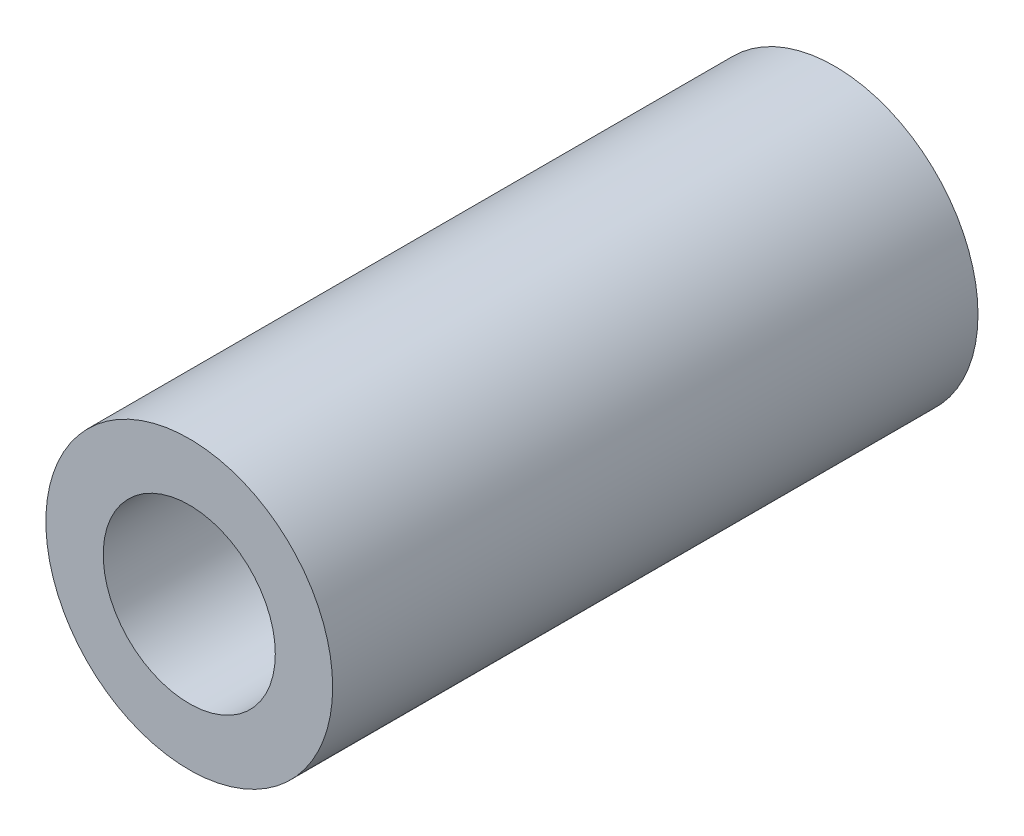
ISO-10303-21;
HEADER;
FILE_DESCRIPTION(('STEP AP214'),'2;1');
FILE_NAME('part.step','',(''),(''),'','','');
FILE_SCHEMA(('AUTOMOTIVE_DESIGN { 1 0 10303 214 1 1 1 1 }'));
ENDSEC;
DATA;
#1=APPLICATION_CONTEXT('core data for automotive mechanical design processes');
#2=APPLICATION_PROTOCOL_DEFINITION('international standard','automotive_design',2000,#1);
#3=PRODUCT_CONTEXT('',#1,'mechanical');
#4=PRODUCT('Part','Part','',(#3));
#5=PRODUCT_RELATED_PRODUCT_CATEGORY('part','',(#4));
#6=PRODUCT_DEFINITION_FORMATION('','',#4);
#7=PRODUCT_DEFINITION_CONTEXT('part definition',#1,'design');
#8=PRODUCT_DEFINITION('design','',#6,#7);
#9=PRODUCT_DEFINITION_SHAPE('','',#8);
#10=(LENGTH_UNIT() NAMED_UNIT(*) SI_UNIT(.MILLI.,.METRE.));
#11=(NAMED_UNIT(*) PLANE_ANGLE_UNIT() SI_UNIT($,.RADIAN.));
#12=(NAMED_UNIT(*) SI_UNIT($,.STERADIAN.) SOLID_ANGLE_UNIT());
#13=UNCERTAINTY_MEASURE_WITH_UNIT(LENGTH_MEASURE(1.E-05),#10,'distance_accuracy_value','');
#14=(GEOMETRIC_REPRESENTATION_CONTEXT(3) GLOBAL_UNCERTAINTY_ASSIGNED_CONTEXT((#13)) GLOBAL_UNIT_ASSIGNED_CONTEXT((#10,
#11,#12)) REPRESENTATION_CONTEXT('',''));
#15=CARTESIAN_POINT('',(0.,0.,0.));
#16=DIRECTION('',(0.,0.,1.));
#17=DIRECTION('',(1.,0.,0.));
#18=AXIS2_PLACEMENT_3D('',#15,#16,#17);
#19=CARTESIAN_POINT('',(0.,0.,45.));
#20=DIRECTION('',(0.,0.,1.));
#21=DIRECTION('',(1.,0.,0.));
#22=AXIS2_PLACEMENT_3D('',#19,#20,#21);
#23=PLANE('',#22);
#24=CARTESIAN_POINT('',(0.,0.,45.));
#25=DIRECTION('',(0.,0.,1.));
#26=DIRECTION('',(1.,0.,0.));
#27=AXIS2_PLACEMENT_3D('',#24,#25,#26);
#28=CIRCLE('',#27,10.);
#29=CARTESIAN_POINT('',(10.,0.,45.));
#30=VERTEX_POINT('',#29);
#31=EDGE_CURVE('E10',#30,#30,#28,.T.);
#32=ORIENTED_EDGE('',*,*,#31,.T.);
#33=EDGE_LOOP('',(#32));
#34=FACE_BOUND('',#33,.T.);
#35=CARTESIAN_POINT('',(0.,0.,45.));
#36=DIRECTION('',(0.,0.,1.));
#37=DIRECTION('',(1.,0.,0.));
#38=AXIS2_PLACEMENT_3D('',#35,#36,#37);
#39=CIRCLE('',#38,6.);
#40=CARTESIAN_POINT('',(6.,0.,45.));
#41=VERTEX_POINT('',#40);
#42=EDGE_CURVE('E42',#41,#41,#39,.T.);
#43=ORIENTED_EDGE('',*,*,#42,.F.);
#44=EDGE_LOOP('',(#43));
#45=FACE_BOUND('',#44,.T.);
#46=ADVANCED_FACE('F31',(#34,#45),#23,.T.);
#47=CARTESIAN_POINT('',(0.,0.,0.));
#48=DIRECTION('',(0.,0.,1.));
#49=DIRECTION('',(1.,0.,0.));
#50=AXIS2_PLACEMENT_3D('',#47,#48,#49);
#51=PLANE('',#50);
#52=CARTESIAN_POINT('',(0.,0.,0.));
#53=DIRECTION('',(0.,0.,1.));
#54=DIRECTION('',(1.,0.,0.));
#55=AXIS2_PLACEMENT_3D('',#52,#53,#54);
#56=CIRCLE('',#55,10.);
#57=CARTESIAN_POINT('',(10.,0.,0.));
#58=VERTEX_POINT('',#57);
#59=EDGE_CURVE('E35',#58,#58,#56,.T.);
#60=ORIENTED_EDGE('',*,*,#59,.F.);
#61=EDGE_LOOP('',(#60));
#62=FACE_BOUND('',#61,.T.);
#63=CARTESIAN_POINT('',(0.,0.,0.));
#64=DIRECTION('',(0.,0.,1.));
#65=DIRECTION('',(1.,0.,0.));
#66=AXIS2_PLACEMENT_3D('',#63,#64,#65);
#67=CIRCLE('',#66,6.);
#68=CARTESIAN_POINT('',(6.,0.,0.));
#69=VERTEX_POINT('',#68);
#70=EDGE_CURVE('E44',#69,#69,#67,.T.);
#71=ORIENTED_EDGE('',*,*,#70,.T.);
#72=EDGE_LOOP('',(#71));
#73=FACE_BOUND('',#72,.T.);
#74=ADVANCED_FACE('F54',(#62,#73),#51,.F.);
#75=CARTESIAN_POINT('',(0.,0.,45.));
#76=DIRECTION('',(0.,0.,-1.));
#77=DIRECTION('',(-1.,0.,0.));
#78=AXIS2_PLACEMENT_3D('',#75,#76,#77);
#79=CYLINDRICAL_SURFACE('',#78,10.);
#80=ORIENTED_EDGE('',*,*,#31,.F.);
#81=EDGE_LOOP('',(#80));
#82=FACE_BOUND('',#81,.T.);
#83=ORIENTED_EDGE('',*,*,#59,.T.);
#84=EDGE_LOOP('',(#83));
#85=FACE_BOUND('',#84,.T.);
#86=ADVANCED_FACE('F33',(#82,#85),#79,.T.);
#87=CARTESIAN_POINT('',(0.,0.,45.));
#88=DIRECTION('',(0.,0.,-1.));
#89=DIRECTION('',(-1.,0.,0.));
#90=AXIS2_PLACEMENT_3D('',#87,#88,#89);
#91=CYLINDRICAL_SURFACE('',#90,6.);
#92=ORIENTED_EDGE('',*,*,#42,.T.);
#93=EDGE_LOOP('',(#92));
#94=FACE_BOUND('',#93,.T.);
#95=ORIENTED_EDGE('',*,*,#70,.F.);
#96=EDGE_LOOP('',(#95));
#97=FACE_BOUND('',#96,.T.);
#98=ADVANCED_FACE('F50',(#94,#97),#91,.F.);
#99=CLOSED_SHELL('',(#46,#74,#86,#98));
#100=MANIFOLD_SOLID_BREP('B2',#99);
#101=ADVANCED_BREP_SHAPE_REPRESENTATION('',(#18,#100),#14);
#102=SHAPE_DEFINITION_REPRESENTATION(#9,#101);
ENDSEC;
END-ISO-10303-21;
